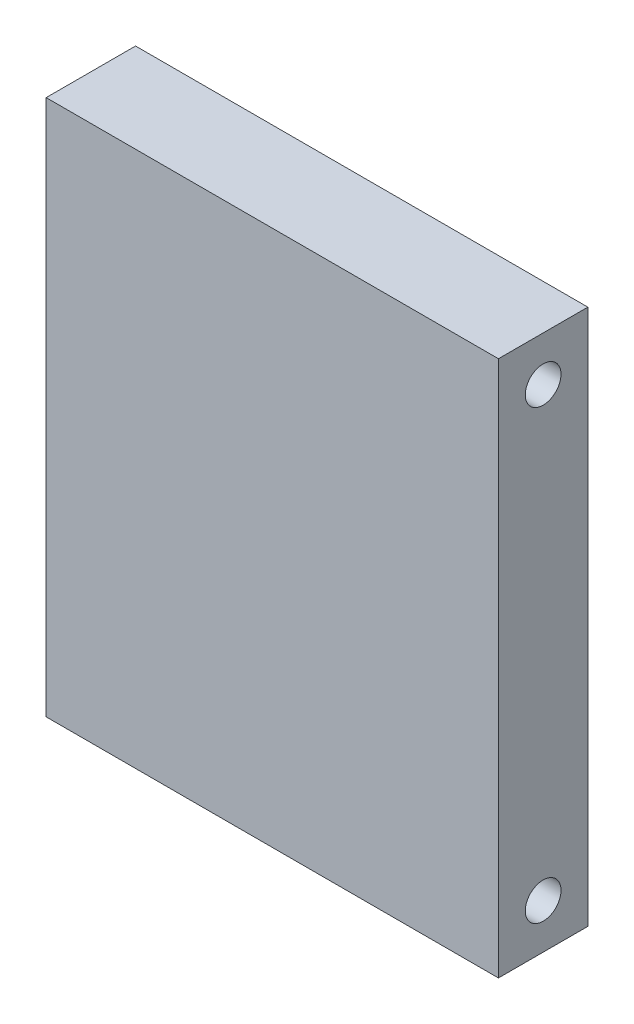
ISO-10303-21;
HEADER;
FILE_DESCRIPTION(('STEP AP214'),'2;1');
FILE_NAME('part.step','',(''),(''),'','','');
FILE_SCHEMA(('AUTOMOTIVE_DESIGN { 1 0 10303 214 1 1 1 1 }'));
ENDSEC;
DATA;
#1=APPLICATION_CONTEXT('core data for automotive mechanical design processes');
#2=APPLICATION_PROTOCOL_DEFINITION('international standard','automotive_design',2000,#1);
#3=PRODUCT_CONTEXT('',#1,'mechanical');
#4=PRODUCT('Part','Part','',(#3));
#5=PRODUCT_RELATED_PRODUCT_CATEGORY('part','',(#4));
#6=PRODUCT_DEFINITION_FORMATION('','',#4);
#7=PRODUCT_DEFINITION_CONTEXT('part definition',#1,'design');
#8=PRODUCT_DEFINITION('design','',#6,#7);
#9=PRODUCT_DEFINITION_SHAPE('','',#8);
#10=(LENGTH_UNIT() NAMED_UNIT(*) SI_UNIT(.MILLI.,.METRE.));
#11=(NAMED_UNIT(*) PLANE_ANGLE_UNIT() SI_UNIT($,.RADIAN.));
#12=(NAMED_UNIT(*) SI_UNIT($,.STERADIAN.) SOLID_ANGLE_UNIT());
#13=UNCERTAINTY_MEASURE_WITH_UNIT(LENGTH_MEASURE(1.E-05),#10,'distance_accuracy_value','');
#14=(GEOMETRIC_REPRESENTATION_CONTEXT(3) GLOBAL_UNCERTAINTY_ASSIGNED_CONTEXT((#13)) GLOBAL_UNIT_ASSIGNED_CONTEXT((#10,
#11,#12)) REPRESENTATION_CONTEXT('',''));
#15=CARTESIAN_POINT('',(0.,0.,0.));
#16=DIRECTION('',(0.,0.,1.));
#17=DIRECTION('',(1.,0.,0.));
#18=AXIS2_PLACEMENT_3D('',#15,#16,#17);
#19=CARTESIAN_POINT('',(0.,0.,10.));
#20=DIRECTION('',(1.,0.,0.));
#21=DIRECTION('',(0.,1.,0.));
#22=AXIS2_PLACEMENT_3D('',#19,#20,#21);
#23=PLANE('',#22);
#24=CARTESIAN_POINT('',(0.,4.99999999999999,5.00000000000002));
#25=DIRECTION('',(-1.,0.,0.));
#26=DIRECTION('',(0.,-1.,0.));
#27=AXIS2_PLACEMENT_3D('',#24,#25,#26);
#28=CIRCLE('',#27,2.);
#29=CARTESIAN_POINT('',(0.,2.99999999999999,5.00000000000002));
#30=VERTEX_POINT('',#29);
#31=EDGE_CURVE('E127',#30,#30,#28,.T.);
#32=ORIENTED_EDGE('',*,*,#31,.F.);
#33=EDGE_LOOP('',(#32));
#34=FACE_BOUND('',#33,.T.);
#35=CARTESIAN_POINT('',(0.,55.,5.00000000000002));
#36=DIRECTION('',(-1.,0.,0.));
#37=DIRECTION('',(0.,-1.,0.));
#38=AXIS2_PLACEMENT_3D('',#35,#36,#37);
#39=CIRCLE('',#38,2.);
#40=CARTESIAN_POINT('',(0.,53.,5.00000000000002));
#41=VERTEX_POINT('',#40);
#42=EDGE_CURVE('E89',#41,#41,#39,.T.);
#43=ORIENTED_EDGE('',*,*,#42,.F.);
#44=EDGE_LOOP('',(#43));
#45=FACE_BOUND('',#44,.T.);
#46=DIRECTION('',(0.,-1.,0.));
#47=VECTOR('',#46,1.);
#48=CARTESIAN_POINT('',(0.,0.,0.));
#49=LINE('',#48,#47);
#50=CARTESIAN_POINT('',(0.,60.,0.));
#51=VERTEX_POINT('',#50);
#52=CARTESIAN_POINT('',(0.,0.,0.));
#53=VERTEX_POINT('',#52);
#54=EDGE_CURVE('E73',#51,#53,#49,.T.);
#55=ORIENTED_EDGE('',*,*,#54,.T.);
#56=DIRECTION('',(0.,0.,-1.));
#57=VECTOR('',#56,1.);
#58=CARTESIAN_POINT('',(0.,0.,10.));
#59=LINE('',#58,#57);
#60=CARTESIAN_POINT('',(0.,0.,10.));
#61=VERTEX_POINT('',#60);
#62=EDGE_CURVE('E11',#61,#53,#59,.T.);
#63=ORIENTED_EDGE('',*,*,#62,.F.);
#64=DIRECTION('',(0.,-1.,0.));
#65=VECTOR('',#64,1.);
#66=CARTESIAN_POINT('',(0.,0.,10.));
#67=LINE('',#66,#65);
#68=CARTESIAN_POINT('',(0.,60.,10.));
#69=VERTEX_POINT('',#68);
#70=EDGE_CURVE('E96',#69,#61,#67,.T.);
#71=ORIENTED_EDGE('',*,*,#70,.F.);
#72=DIRECTION('',(0.,0.,-1.));
#73=VECTOR('',#72,1.);
#74=CARTESIAN_POINT('',(0.,60.,10.));
#75=LINE('',#74,#73);
#76=EDGE_CURVE('E85',#69,#51,#75,.T.);
#77=ORIENTED_EDGE('',*,*,#76,.T.);
#78=EDGE_LOOP('',(#55,#63,#71,#77));
#79=FACE_BOUND('',#78,.T.);
#80=ADVANCED_FACE('F29',(#34,#45,#79),#23,.F.);
#81=CARTESIAN_POINT('',(0.,0.,10.));
#82=DIRECTION('',(0.,1.,0.));
#83=DIRECTION('',(0.,0.,1.));
#84=AXIS2_PLACEMENT_3D('',#81,#82,#83);
#85=PLANE('',#84);
#86=DIRECTION('',(1.,0.,0.));
#87=VECTOR('',#86,1.);
#88=CARTESIAN_POINT('',(0.,0.,0.));
#89=LINE('',#88,#87);
#90=CARTESIAN_POINT('',(50.6,0.,0.));
#91=VERTEX_POINT('',#90);
#92=EDGE_CURVE('E69',#53,#91,#89,.T.);
#93=ORIENTED_EDGE('',*,*,#92,.T.);
#94=DIRECTION('',(0.,0.,-1.));
#95=VECTOR('',#94,1.);
#96=CARTESIAN_POINT('',(50.6,0.,10.));
#97=LINE('',#96,#95);
#98=CARTESIAN_POINT('',(50.6,0.,10.));
#99=VERTEX_POINT('',#98);
#100=EDGE_CURVE('E36',#99,#91,#97,.T.);
#101=ORIENTED_EDGE('',*,*,#100,.F.);
#102=DIRECTION('',(1.,0.,0.));
#103=VECTOR('',#102,1.);
#104=CARTESIAN_POINT('',(0.,0.,10.));
#105=LINE('',#104,#103);
#106=EDGE_CURVE('E81',#61,#99,#105,.T.);
#107=ORIENTED_EDGE('',*,*,#106,.F.);
#108=ORIENTED_EDGE('',*,*,#62,.T.);
#109=EDGE_LOOP('',(#93,#101,#107,#108));
#110=FACE_BOUND('',#109,.T.);
#111=ADVANCED_FACE('F80',(#110),#85,.F.);
#112=CARTESIAN_POINT('',(50.6,0.,10.));
#113=DIRECTION('',(-1.,0.,0.));
#114=DIRECTION('',(0.,-1.,0.));
#115=AXIS2_PLACEMENT_3D('',#112,#113,#114);
#116=PLANE('',#115);
#117=CARTESIAN_POINT('',(50.6,4.99999999999999,5.00000000000002));
#118=DIRECTION('',(-1.,0.,0.));
#119=DIRECTION('',(0.,-1.,0.));
#120=AXIS2_PLACEMENT_3D('',#117,#118,#119);
#121=CIRCLE('',#120,2.);
#122=CARTESIAN_POINT('',(50.6,2.99999999999999,5.00000000000002));
#123=VERTEX_POINT('',#122);
#124=EDGE_CURVE('E131',#123,#123,#121,.T.);
#125=ORIENTED_EDGE('',*,*,#124,.T.);
#126=EDGE_LOOP('',(#125));
#127=FACE_BOUND('',#126,.T.);
#128=CARTESIAN_POINT('',(50.6,55.,5.00000000000002));
#129=DIRECTION('',(-1.,0.,0.));
#130=DIRECTION('',(0.,-1.,0.));
#131=AXIS2_PLACEMENT_3D('',#128,#129,#130);
#132=CIRCLE('',#131,2.);
#133=CARTESIAN_POINT('',(50.6,53.,5.00000000000002));
#134=VERTEX_POINT('',#133);
#135=EDGE_CURVE('E86',#134,#134,#132,.T.);
#136=ORIENTED_EDGE('',*,*,#135,.T.);
#137=EDGE_LOOP('',(#136));
#138=FACE_BOUND('',#137,.T.);
#139=DIRECTION('',(0.,1.,0.));
#140=VECTOR('',#139,1.);
#141=CARTESIAN_POINT('',(50.6,0.,0.));
#142=LINE('',#141,#140);
#143=CARTESIAN_POINT('',(50.6,60.,0.));
#144=VERTEX_POINT('',#143);
#145=EDGE_CURVE('E74',#91,#144,#142,.T.);
#146=ORIENTED_EDGE('',*,*,#145,.T.);
#147=DIRECTION('',(0.,0.,-1.));
#148=VECTOR('',#147,1.);
#149=CARTESIAN_POINT('',(50.6,60.,10.));
#150=LINE('',#149,#148);
#151=CARTESIAN_POINT('',(50.6,60.,10.));
#152=VERTEX_POINT('',#151);
#153=EDGE_CURVE('E102',#152,#144,#150,.T.);
#154=ORIENTED_EDGE('',*,*,#153,.F.);
#155=DIRECTION('',(0.,1.,0.));
#156=VECTOR('',#155,1.);
#157=CARTESIAN_POINT('',(50.6,0.,10.));
#158=LINE('',#157,#156);
#159=EDGE_CURVE('E48',#99,#152,#158,.T.);
#160=ORIENTED_EDGE('',*,*,#159,.F.);
#161=ORIENTED_EDGE('',*,*,#100,.T.);
#162=EDGE_LOOP('',(#146,#154,#160,#161));
#163=FACE_BOUND('',#162,.T.);
#164=ADVANCED_FACE('F105',(#127,#138,#163),#116,.F.);
#165=CARTESIAN_POINT('',(0.,60.,10.));
#166=DIRECTION('',(0.,-1.,0.));
#167=DIRECTION('',(0.,0.,-1.));
#168=AXIS2_PLACEMENT_3D('',#165,#166,#167);
#169=PLANE('',#168);
#170=DIRECTION('',(-1.,0.,0.));
#171=VECTOR('',#170,1.);
#172=CARTESIAN_POINT('',(0.,60.,0.));
#173=LINE('',#172,#171);
#174=EDGE_CURVE('E94',#144,#51,#173,.T.);
#175=ORIENTED_EDGE('',*,*,#174,.T.);
#176=ORIENTED_EDGE('',*,*,#76,.F.);
#177=DIRECTION('',(-1.,0.,0.));
#178=VECTOR('',#177,1.);
#179=CARTESIAN_POINT('',(0.,60.,10.));
#180=LINE('',#179,#178);
#181=EDGE_CURVE('E43',#152,#69,#180,.T.);
#182=ORIENTED_EDGE('',*,*,#181,.F.);
#183=ORIENTED_EDGE('',*,*,#153,.T.);
#184=EDGE_LOOP('',(#175,#176,#182,#183));
#185=FACE_BOUND('',#184,.T.);
#186=ADVANCED_FACE('F107',(#185),#169,.F.);
#187=CARTESIAN_POINT('',(0.,60.,10.));
#188=DIRECTION('',(0.,0.,-1.));
#189=DIRECTION('',(-1.,0.,0.));
#190=AXIS2_PLACEMENT_3D('',#187,#188,#189);
#191=PLANE('',#190);
#192=ORIENTED_EDGE('',*,*,#70,.T.);
#193=ORIENTED_EDGE('',*,*,#106,.T.);
#194=ORIENTED_EDGE('',*,*,#159,.T.);
#195=ORIENTED_EDGE('',*,*,#181,.T.);
#196=EDGE_LOOP('',(#192,#193,#194,#195));
#197=FACE_BOUND('',#196,.T.);
#198=ADVANCED_FACE('F108',(#197),#191,.F.);
#199=CARTESIAN_POINT('',(0.,60.,0.));
#200=DIRECTION('',(0.,0.,-1.));
#201=DIRECTION('',(-1.,0.,0.));
#202=AXIS2_PLACEMENT_3D('',#199,#200,#201);
#203=PLANE('',#202);
#204=ORIENTED_EDGE('',*,*,#54,.F.);
#205=ORIENTED_EDGE('',*,*,#174,.F.);
#206=ORIENTED_EDGE('',*,*,#145,.F.);
#207=ORIENTED_EDGE('',*,*,#92,.F.);
#208=EDGE_LOOP('',(#204,#205,#206,#207));
#209=FACE_BOUND('',#208,.T.);
#210=ADVANCED_FACE('F70',(#209),#203,.T.);
#211=CARTESIAN_POINT('',(50.6,55.,5.00000000000002));
#212=DIRECTION('',(-1.,0.,0.));
#213=DIRECTION('',(0.,-1.,0.));
#214=AXIS2_PLACEMENT_3D('',#211,#212,#213);
#215=CYLINDRICAL_SURFACE('',#214,2.);
#216=ORIENTED_EDGE('',*,*,#135,.F.);
#217=EDGE_LOOP('',(#216));
#218=FACE_BOUND('',#217,.T.);
#219=ORIENTED_EDGE('',*,*,#42,.T.);
#220=EDGE_LOOP('',(#219));
#221=FACE_BOUND('',#220,.T.);
#222=ADVANCED_FACE('F115',(#218,#221),#215,.F.);
#223=CARTESIAN_POINT('',(50.6,4.99999999999999,5.00000000000002));
#224=DIRECTION('',(-1.,0.,0.));
#225=DIRECTION('',(0.,-1.,0.));
#226=AXIS2_PLACEMENT_3D('',#223,#224,#225);
#227=CYLINDRICAL_SURFACE('',#226,2.);
#228=ORIENTED_EDGE('',*,*,#124,.F.);
#229=EDGE_LOOP('',(#228));
#230=FACE_BOUND('',#229,.T.);
#231=ORIENTED_EDGE('',*,*,#31,.T.);
#232=EDGE_LOOP('',(#231));
#233=FACE_BOUND('',#232,.T.);
#234=ADVANCED_FACE('F136',(#230,#233),#227,.F.);
#235=CLOSED_SHELL('',(#80,#111,#164,#186,#198,#210,#222,#234));
#236=MANIFOLD_SOLID_BREP('B2',#235);
#237=ADVANCED_BREP_SHAPE_REPRESENTATION('',(#18,#236),#14);
#238=SHAPE_DEFINITION_REPRESENTATION(#9,#237);
ENDSEC;
END-ISO-10303-21;
